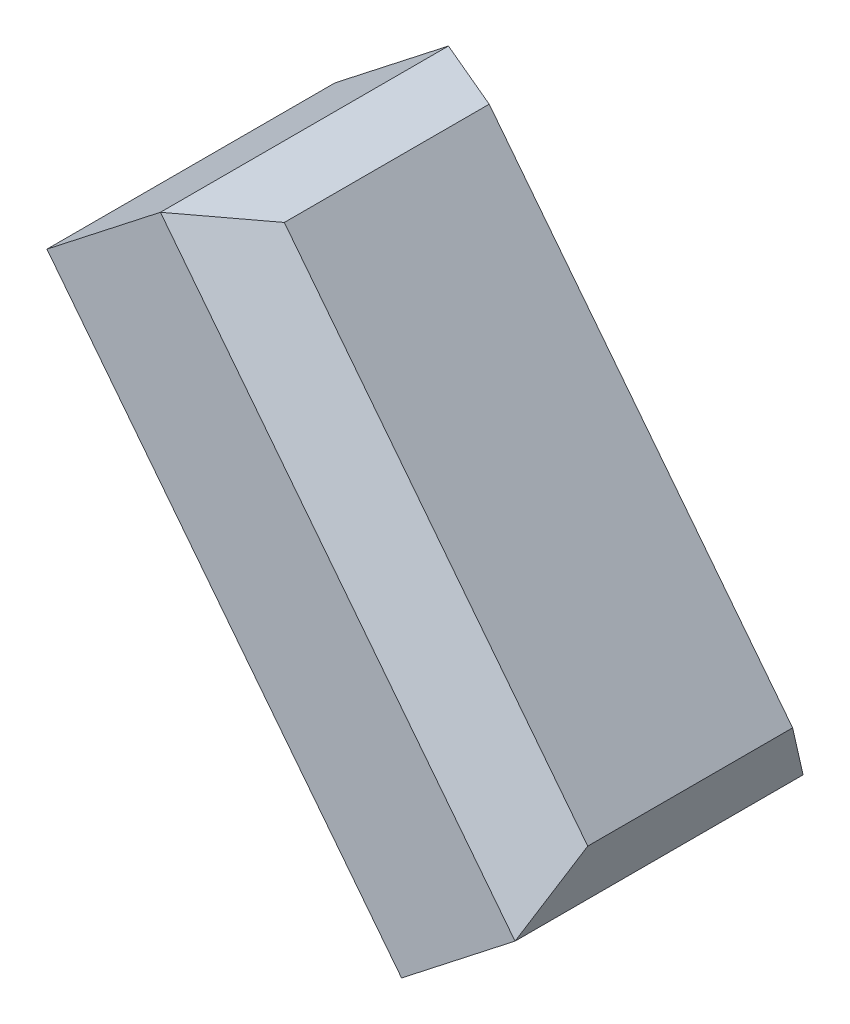
ISO-10303-21;
HEADER;
FILE_DESCRIPTION(('STEP AP214'),'2;1');
FILE_NAME('part.step','',(''),(''),'','','');
FILE_SCHEMA(('AUTOMOTIVE_DESIGN { 1 0 10303 214 1 1 1 1 }'));
ENDSEC;
DATA;
#1=APPLICATION_CONTEXT('core data for automotive mechanical design processes');
#2=APPLICATION_PROTOCOL_DEFINITION('international standard','automotive_design',2000,#1);
#3=PRODUCT_CONTEXT('',#1,'mechanical');
#4=PRODUCT('Part','Part','',(#3));
#5=PRODUCT_RELATED_PRODUCT_CATEGORY('part','',(#4));
#6=PRODUCT_DEFINITION_FORMATION('','',#4);
#7=PRODUCT_DEFINITION_CONTEXT('part definition',#1,'design');
#8=PRODUCT_DEFINITION('design','',#6,#7);
#9=PRODUCT_DEFINITION_SHAPE('','',#8);
#10=(LENGTH_UNIT() NAMED_UNIT(*) SI_UNIT(.MILLI.,.METRE.));
#11=(NAMED_UNIT(*) PLANE_ANGLE_UNIT() SI_UNIT($,.RADIAN.));
#12=(NAMED_UNIT(*) SI_UNIT($,.STERADIAN.) SOLID_ANGLE_UNIT());
#13=UNCERTAINTY_MEASURE_WITH_UNIT(LENGTH_MEASURE(1.E-05),#10,'distance_accuracy_value','');
#14=(GEOMETRIC_REPRESENTATION_CONTEXT(3) GLOBAL_UNCERTAINTY_ASSIGNED_CONTEXT((#13)) GLOBAL_UNIT_ASSIGNED_CONTEXT((#10,
#11,#12)) REPRESENTATION_CONTEXT('',''));
#15=CARTESIAN_POINT('',(0.,0.,0.));
#16=DIRECTION('',(0.,0.,1.));
#17=DIRECTION('',(1.,0.,0.));
#18=AXIS2_PLACEMENT_3D('',#15,#16,#17);
#19=CARTESIAN_POINT('',(23.6403226082017,18.4698442597697,0.));
#20=DIRECTION('',(0.,0.,-1.));
#21=DIRECTION('',(-1.,0.,0.));
#22=AXIS2_PLACEMENT_3D('',#19,#20,#21);
#23=PLANE('',#22);
#24=DIRECTION('',(-0.788010753606723,-0.615661475325657,0.));
#25=VECTOR('',#24,1.);
#26=CARTESIAN_POINT('',(23.6403226082017,18.4698442597697,0.));
#27=LINE('',#26,#25);
#28=CARTESIAN_POINT('',(15.7602150721344,12.3132295065131,0.));
#29=VERTEX_POINT('',#28);
#30=CARTESIAN_POINT('',(0.,0.,0.));
#31=VERTEX_POINT('',#30);
#32=EDGE_CURVE('E85',#29,#31,#27,.T.);
#33=ORIENTED_EDGE('',*,*,#32,.F.);
#34=DIRECTION('',(-0.615661475325657,0.788010753606723,0.));
#35=VECTOR('',#34,1.);
#36=CARTESIAN_POINT('',(15.7602150721344,12.3132295065131,0.));
#37=LINE('',#36,#35);
#38=CARTESIAN_POINT('',(-33.4927029539181,75.354089795051,0.));
#39=VERTEX_POINT('',#38);
#40=EDGE_CURVE('E11',#29,#39,#37,.T.);
#41=ORIENTED_EDGE('',*,*,#40,.T.);
#42=DIRECTION('',(-0.788010753606723,-0.615661475325657,0.));
#43=VECTOR('',#42,1.);
#44=CARTESIAN_POINT('',(-25.6125954178508,81.5107045483076,0.));
#45=LINE('',#44,#43);
#46=CARTESIAN_POINT('',(-49.2529180260525,63.0408602885379,0.));
#47=VERTEX_POINT('',#46);
#48=EDGE_CURVE('E105',#39,#47,#45,.T.);
#49=ORIENTED_EDGE('',*,*,#48,.T.);
#50=DIRECTION('',(0.615661475325657,-0.788010753606723,0.));
#51=VECTOR('',#50,1.);
#52=CARTESIAN_POINT('',(0.,0.,0.));
#53=LINE('',#52,#51);
#54=EDGE_CURVE('E100',#47,#31,#53,.T.);
#55=ORIENTED_EDGE('',*,*,#54,.T.);
#56=EDGE_LOOP('',(#33,#41,#49,#55));
#57=FACE_BOUND('',#56,.T.);
#58=ADVANCED_FACE('F33',(#57),#23,.F.);
#59=CARTESIAN_POINT('',(23.6403226082017,18.4698442597697,0.));
#60=DIRECTION('',(-0.615661475325657,0.788010753606723,0.));
#61=DIRECTION('',(-0.788010753606723,-0.615661475325657,0.));
#62=AXIS2_PLACEMENT_3D('',#59,#60,#61);
#63=PLANE('',#62);
#64=DIRECTION('',(-0.788010753606723,-0.615661475325657,0.));
#65=VECTOR('',#64,1.);
#66=CARTESIAN_POINT('',(23.6403226082017,18.4698442597697,-40.));
#67=LINE('',#66,#65);
#68=CARTESIAN_POINT('',(15.7602150721344,12.3132295065131,-40.));
#69=VERTEX_POINT('',#68);
#70=CARTESIAN_POINT('',(0.,0.,-40.));
#71=VERTEX_POINT('',#70);
#72=EDGE_CURVE('E94',#69,#71,#67,.T.);
#73=ORIENTED_EDGE('',*,*,#72,.F.);
#74=DIRECTION('',(0.,0.,1.));
#75=VECTOR('',#74,1.);
#76=CARTESIAN_POINT('',(15.7602150721344,12.3132295065131,0.));
#77=LINE('',#76,#75);
#78=EDGE_CURVE('E42',#69,#29,#77,.T.);
#79=ORIENTED_EDGE('',*,*,#78,.T.);
#80=ORIENTED_EDGE('',*,*,#32,.T.);
#81=DIRECTION('',(0.,0.,-1.));
#82=VECTOR('',#81,1.);
#83=CARTESIAN_POINT('',(0.,0.,0.));
#84=LINE('',#83,#82);
#85=EDGE_CURVE('E88',#31,#71,#84,.T.);
#86=ORIENTED_EDGE('',*,*,#85,.T.);
#87=EDGE_LOOP('',(#73,#79,#80,#86));
#88=FACE_BOUND('',#87,.T.);
#89=ADVANCED_FACE('F87',(#88),#63,.F.);
#90=CARTESIAN_POINT('',(23.6403226082017,18.4698442597697,-40.));
#91=DIRECTION('',(0.,0.,1.));
#92=DIRECTION('',(1.,0.,0.));
#93=AXIS2_PLACEMENT_3D('',#90,#91,#92);
#94=PLANE('',#93);
#95=DIRECTION('',(-0.788010753606723,-0.615661475325657,0.));
#96=VECTOR('',#95,1.);
#97=CARTESIAN_POINT('',(-25.6125954178508,81.5107045483076,-40.));
#98=LINE('',#97,#96);
#99=CARTESIAN_POINT('',(-33.4927029539181,75.354089795051,-40.));
#100=VERTEX_POINT('',#99);
#101=CARTESIAN_POINT('',(-49.2529180260525,63.0408602885379,-40.));
#102=VERTEX_POINT('',#101);
#103=EDGE_CURVE('E115',#100,#102,#98,.T.);
#104=ORIENTED_EDGE('',*,*,#103,.F.);
#105=DIRECTION('',(0.615661475325657,-0.788010753606723,0.));
#106=VECTOR('',#105,1.);
#107=CARTESIAN_POINT('',(15.7602150721344,12.3132295065131,-40.));
#108=LINE('',#107,#106);
#109=EDGE_CURVE('E57',#100,#69,#108,.T.);
#110=ORIENTED_EDGE('',*,*,#109,.T.);
#111=ORIENTED_EDGE('',*,*,#72,.T.);
#112=DIRECTION('',(-0.615661475325657,0.788010753606723,0.));
#113=VECTOR('',#112,1.);
#114=CARTESIAN_POINT('',(0.,0.,-40.));
#115=LINE('',#114,#113);
#116=EDGE_CURVE('E102',#71,#102,#115,.T.);
#117=ORIENTED_EDGE('',*,*,#116,.T.);
#118=EDGE_LOOP('',(#104,#110,#111,#117));
#119=FACE_BOUND('',#118,.T.);
#120=ADVANCED_FACE('F153',(#119),#94,.F.);
#121=CARTESIAN_POINT('',(-25.6125954178508,81.5107045483076,0.));
#122=DIRECTION('',(0.615661475325657,-0.788010753606723,0.));
#123=DIRECTION('',(0.788010753606723,0.615661475325657,0.));
#124=AXIS2_PLACEMENT_3D('',#121,#122,#123);
#125=PLANE('',#124);
#126=ORIENTED_EDGE('',*,*,#48,.F.);
#127=DIRECTION('',(0.,0.,-1.));
#128=VECTOR('',#127,1.);
#129=CARTESIAN_POINT('',(-33.4927029539181,75.354089795051,0.));
#130=LINE('',#129,#128);
#131=EDGE_CURVE('E126',#39,#100,#130,.T.);
#132=ORIENTED_EDGE('',*,*,#131,.T.);
#133=ORIENTED_EDGE('',*,*,#103,.T.);
#134=DIRECTION('',(0.,0.,1.));
#135=VECTOR('',#134,1.);
#136=CARTESIAN_POINT('',(-49.2529180260525,63.0408602885379,0.));
#137=LINE('',#136,#135);
#138=EDGE_CURVE('E112',#102,#47,#137,.T.);
#139=ORIENTED_EDGE('',*,*,#138,.T.);
#140=EDGE_LOOP('',(#126,#132,#133,#139));
#141=FACE_BOUND('',#140,.T.);
#142=ADVANCED_FACE('F152',(#141),#125,.F.);
#143=CARTESIAN_POINT('',(23.6403226082017,18.4698442597697,0.));
#144=DIRECTION('',(-0.788010753606723,-0.615661475325657,0.));
#145=DIRECTION('',(0.615661475325657,-0.788010753606723,0.));
#146=AXIS2_PLACEMENT_3D('',#143,#144,#145);
#147=PLANE('',#146);
#148=DIRECTION('',(-0.615661475325657,0.788010753606723,0.));
#149=VECTOR('',#148,1.);
#150=CARTESIAN_POINT('',(23.6403226082017,18.4698442597697,-34.2264973081037));
#151=LINE('',#150,#149);
#152=CARTESIAN_POINT('',(20.0857994231122,23.0194264669613,-34.2264973081037));
#153=VERTEX_POINT('',#152);
#154=CARTESIAN_POINT('',(-22.0580722327613,76.961122341116,-34.2264973081037));
#155=VERTEX_POINT('',#154);
#156=EDGE_CURVE('E121',#153,#155,#151,.T.);
#157=ORIENTED_EDGE('',*,*,#156,.T.);
#158=DIRECTION('',(0.,0.,1.));
#159=VECTOR('',#158,1.);
#160=CARTESIAN_POINT('',(-22.0580722327613,76.961122341116,0.));
#161=LINE('',#160,#159);
#162=CARTESIAN_POINT('',(-22.0580722327613,76.961122341116,-5.77350269189628));
#163=VERTEX_POINT('',#162);
#164=EDGE_CURVE('E123',#155,#163,#161,.T.);
#165=ORIENTED_EDGE('',*,*,#164,.T.);
#166=DIRECTION('',(0.615661475325657,-0.788010753606723,0.));
#167=VECTOR('',#166,1.);
#168=CARTESIAN_POINT('',(23.6403226082017,18.4698442597697,-5.77350269189628));
#169=LINE('',#168,#167);
#170=CARTESIAN_POINT('',(20.0857994231122,23.0194264669613,-5.77350269189628));
#171=VERTEX_POINT('',#170);
#172=EDGE_CURVE('E93',#163,#171,#169,.T.);
#173=ORIENTED_EDGE('',*,*,#172,.T.);
#174=DIRECTION('',(0.,0.,-1.));
#175=VECTOR('',#174,1.);
#176=CARTESIAN_POINT('',(20.0857994231122,23.0194264669613,0.));
#177=LINE('',#176,#175);
#178=EDGE_CURVE('E119',#171,#153,#177,.T.);
#179=ORIENTED_EDGE('',*,*,#178,.T.);
#180=EDGE_LOOP('',(#157,#165,#173,#179));
#181=FACE_BOUND('',#180,.T.);
#182=ADVANCED_FACE('F145',(#181),#147,.F.);
#183=CARTESIAN_POINT('',(0.,0.,0.));
#184=DIRECTION('',(-0.788010753606723,-0.615661475325657,0.));
#185=DIRECTION('',(0.615661475325657,-0.788010753606723,0.));
#186=AXIS2_PLACEMENT_3D('',#183,#184,#185);
#187=PLANE('',#186);
#188=ORIENTED_EDGE('',*,*,#54,.F.);
#189=ORIENTED_EDGE('',*,*,#138,.F.);
#190=ORIENTED_EDGE('',*,*,#116,.F.);
#191=ORIENTED_EDGE('',*,*,#85,.F.);
#192=EDGE_LOOP('',(#188,#189,#190,#191));
#193=FACE_BOUND('',#192,.T.);
#194=ADVANCED_FACE('F98',(#193),#187,.T.);
#195=CARTESIAN_POINT('',(20.0857994231122,23.0194264669613,0.));
#196=DIRECTION('',(-0.927183854566786,0.374606593415915,0.));
#197=DIRECTION('',(0.,0.,-1.));
#198=AXIS2_PLACEMENT_3D('',#195,#196,#197);
#199=PLANE('',#198);
#200=DIRECTION('',(0.335058323079045,0.829298450580646,-0.447213595499957));
#201=VECTOR('',#200,1.);
#202=CARTESIAN_POINT('',(19.2206825529166,20.8781870748717,-4.61880215351703));
#203=LINE('',#202,#201);
#204=EDGE_CURVE('E109',#29,#171,#203,.T.);
#205=ORIENTED_EDGE('',*,*,#204,.F.);
#206=ORIENTED_EDGE('',*,*,#78,.F.);
#207=DIRECTION('',(0.335058323079045,0.829298450580646,0.447213595499957));
#208=VECTOR('',#207,1.);
#209=CARTESIAN_POINT('',(25.2143880475713,35.7131287479402,-27.381197846483));
#210=LINE('',#209,#208);
#211=EDGE_CURVE('E37',#153,#69,#210,.F.);
#212=ORIENTED_EDGE('',*,*,#211,.F.);
#213=ORIENTED_EDGE('',*,*,#178,.F.);
#214=EDGE_LOOP('',(#205,#206,#212,#213));
#215=FACE_BOUND('',#214,.T.);
#216=ADVANCED_FACE('F35',(#215),#199,.F.);
#217=CARTESIAN_POINT('',(23.6403226082017,18.4698442597697,-34.2264973081037));
#218=DIRECTION('',(-0.39400537680336,-0.307830737662827,0.86602540378444));
#219=DIRECTION('',(-0.615661475325657,0.788010753606723,0.));
#220=AXIS2_PLACEMENT_3D('',#217,#218,#219);
#221=PLANE('',#220);
#222=ORIENTED_EDGE('',*,*,#211,.T.);
#223=ORIENTED_EDGE('',*,*,#109,.F.);
#224=DIRECTION('',(0.885722687061435,0.12448020575446,0.447213595499957));
#225=VECTOR('',#224,1.);
#226=CARTESIAN_POINT('',(7.34357982273745,81.0932550626251,-19.3811978464831));
#227=LINE('',#226,#225);
#228=EDGE_CURVE('E133',#155,#100,#227,.F.);
#229=ORIENTED_EDGE('',*,*,#228,.F.);
#230=ORIENTED_EDGE('',*,*,#156,.F.);
#231=EDGE_LOOP('',(#222,#223,#229,#230));
#232=FACE_BOUND('',#231,.T.);
#233=ADVANCED_FACE('F170',(#232),#221,.F.);
#234=CARTESIAN_POINT('',(23.6403226082017,18.4698442597697,-5.77350269189628));
#235=DIRECTION('',(-0.39400537680336,-0.307830737662827,-0.86602540378444));
#236=DIRECTION('',(0.615661475325657,-0.788010753606723,0.));
#237=AXIS2_PLACEMENT_3D('',#234,#235,#236);
#238=PLANE('',#237);
#239=ORIENTED_EDGE('',*,*,#204,.T.);
#240=ORIENTED_EDGE('',*,*,#172,.F.);
#241=DIRECTION('',(-0.885722687061435,-0.12448020575446,0.447213595499957));
#242=VECTOR('',#241,1.);
#243=CARTESIAN_POINT('',(7.34357982273745,81.0932550626251,-20.6188021535169));
#244=LINE('',#243,#242);
#245=EDGE_CURVE('E131',#39,#163,#244,.F.);
#246=ORIENTED_EDGE('',*,*,#245,.F.);
#247=ORIENTED_EDGE('',*,*,#40,.F.);
#248=EDGE_LOOP('',(#239,#240,#246,#247));
#249=FACE_BOUND('',#248,.T.);
#250=ADVANCED_FACE('F138',(#249),#238,.F.);
#251=CARTESIAN_POINT('',(-22.0580722327613,76.961122341116,0.));
#252=DIRECTION('',(0.139173100960066,-0.99026806874157,0.));
#253=DIRECTION('',(0.,0.,1.));
#254=AXIS2_PLACEMENT_3D('',#251,#252,#253);
#255=PLANE('',#254);
#256=ORIENTED_EDGE('',*,*,#228,.T.);
#257=ORIENTED_EDGE('',*,*,#131,.F.);
#258=ORIENTED_EDGE('',*,*,#245,.T.);
#259=ORIENTED_EDGE('',*,*,#164,.F.);
#260=EDGE_LOOP('',(#256,#257,#258,#259));
#261=FACE_BOUND('',#260,.T.);
#262=ADVANCED_FACE('F149',(#261),#255,.F.);
#263=CLOSED_SHELL('',(#58,#89,#120,#142,#182,#194,#216,#233,#250,#262));
#264=MANIFOLD_SOLID_BREP('B2',#263);
#265=ADVANCED_BREP_SHAPE_REPRESENTATION('',(#18,#264),#14);
#266=SHAPE_DEFINITION_REPRESENTATION(#9,#265);
ENDSEC;
END-ISO-10303-21;
